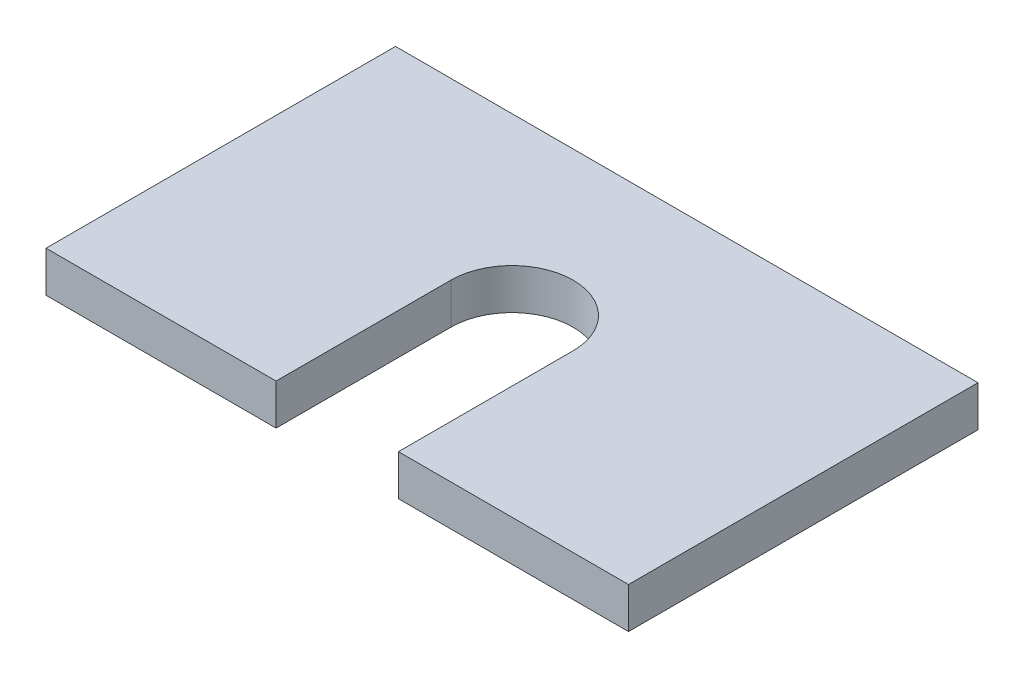
ISO-10303-21;
HEADER;
FILE_DESCRIPTION(('STEP AP214'),'2;1');
FILE_NAME('part.step','',(''),(''),'','','');
FILE_SCHEMA(('AUTOMOTIVE_DESIGN { 1 0 10303 214 1 1 1 1 }'));
ENDSEC;
DATA;
#1=APPLICATION_CONTEXT('core data for automotive mechanical design processes');
#2=APPLICATION_PROTOCOL_DEFINITION('international standard','automotive_design',2000,#1);
#3=PRODUCT_CONTEXT('',#1,'mechanical');
#4=PRODUCT('Part','Part','',(#3));
#5=PRODUCT_RELATED_PRODUCT_CATEGORY('part','',(#4));
#6=PRODUCT_DEFINITION_FORMATION('','',#4);
#7=PRODUCT_DEFINITION_CONTEXT('part definition',#1,'design');
#8=PRODUCT_DEFINITION('design','',#6,#7);
#9=PRODUCT_DEFINITION_SHAPE('','',#8);
#10=(LENGTH_UNIT() NAMED_UNIT(*) SI_UNIT(.MILLI.,.METRE.));
#11=(NAMED_UNIT(*) PLANE_ANGLE_UNIT() SI_UNIT($,.RADIAN.));
#12=(NAMED_UNIT(*) SI_UNIT($,.STERADIAN.) SOLID_ANGLE_UNIT());
#13=UNCERTAINTY_MEASURE_WITH_UNIT(LENGTH_MEASURE(1.E-05),#10,'distance_accuracy_value','');
#14=(GEOMETRIC_REPRESENTATION_CONTEXT(3) GLOBAL_UNCERTAINTY_ASSIGNED_CONTEXT((#13)) GLOBAL_UNIT_ASSIGNED_CONTEXT((#10,
#11,#12)) REPRESENTATION_CONTEXT('',''));
#15=CARTESIAN_POINT('',(0.,0.,0.));
#16=DIRECTION('',(0.,0.,1.));
#17=DIRECTION('',(1.,0.,0.));
#18=AXIS2_PLACEMENT_3D('',#15,#16,#17);
#19=CARTESIAN_POINT('',(0.,8.89,0.));
#20=DIRECTION('',(0.,-1.,0.));
#21=DIRECTION('',(0.,0.,-1.));
#22=AXIS2_PLACEMENT_3D('',#19,#20,#21);
#23=CYLINDRICAL_SURFACE('',#22,13.335);
#24=CARTESIAN_POINT('',(0.,0.,0.));
#25=DIRECTION('',(0.,1.,0.));
#26=DIRECTION('',(0.,0.,1.));
#27=AXIS2_PLACEMENT_3D('',#24,#25,#26);
#28=CIRCLE('',#27,13.335);
#29=CARTESIAN_POINT('',(13.335,0.,0.));
#30=VERTEX_POINT('',#29);
#31=CARTESIAN_POINT('',(-13.335,0.,0.));
#32=VERTEX_POINT('',#31);
#33=EDGE_CURVE('E189',#30,#32,#28,.T.);
#34=ORIENTED_EDGE('',*,*,#33,.F.);
#35=DIRECTION('',(0.,-1.,0.));
#36=VECTOR('',#35,1.);
#37=CARTESIAN_POINT('',(13.335,8.89,0.));
#38=LINE('',#37,#36);
#39=CARTESIAN_POINT('',(13.335,8.89,0.));
#40=VERTEX_POINT('',#39);
#41=EDGE_CURVE('E11',#40,#30,#38,.T.);
#42=ORIENTED_EDGE('',*,*,#41,.F.);
#43=CARTESIAN_POINT('',(0.,8.89,0.));
#44=DIRECTION('',(0.,1.,0.));
#45=DIRECTION('',(0.,0.,1.));
#46=AXIS2_PLACEMENT_3D('',#43,#44,#45);
#47=CIRCLE('',#46,13.335);
#48=CARTESIAN_POINT('',(-13.335,8.89,0.));
#49=VERTEX_POINT('',#48);
#50=EDGE_CURVE('E151',#40,#49,#47,.T.);
#51=ORIENTED_EDGE('',*,*,#50,.T.);
#52=DIRECTION('',(0.,-1.,0.));
#53=VECTOR('',#52,1.);
#54=CARTESIAN_POINT('',(-13.335,8.89,0.));
#55=LINE('',#54,#53);
#56=EDGE_CURVE('E58',#49,#32,#55,.T.);
#57=ORIENTED_EDGE('',*,*,#56,.T.);
#58=EDGE_LOOP('',(#34,#42,#51,#57));
#59=FACE_BOUND('',#58,.T.);
#60=ADVANCED_FACE('F41',(#59),#23,.F.);
#61=CARTESIAN_POINT('',(13.335,8.89,0.));
#62=DIRECTION('',(1.,0.,0.));
#63=DIRECTION('',(0.,0.,-1.));
#64=AXIS2_PLACEMENT_3D('',#61,#62,#63);
#65=PLANE('',#64);
#66=DIRECTION('',(0.,0.,1.));
#67=VECTOR('',#66,1.);
#68=CARTESIAN_POINT('',(13.335,0.,0.));
#69=LINE('',#68,#67);
#70=CARTESIAN_POINT('',(13.335,0.,38.1));
#71=VERTEX_POINT('',#70);
#72=EDGE_CURVE('E186',#30,#71,#69,.T.);
#73=ORIENTED_EDGE('',*,*,#72,.T.);
#74=DIRECTION('',(0.,-1.,0.));
#75=VECTOR('',#74,1.);
#76=CARTESIAN_POINT('',(13.335,8.89,38.1));
#77=LINE('',#76,#75);
#78=CARTESIAN_POINT('',(13.335,8.89,38.1));
#79=VERTEX_POINT('',#78);
#80=EDGE_CURVE('E50',#79,#71,#77,.T.);
#81=ORIENTED_EDGE('',*,*,#80,.F.);
#82=DIRECTION('',(0.,0.,1.));
#83=VECTOR('',#82,1.);
#84=CARTESIAN_POINT('',(13.335,8.89,0.));
#85=LINE('',#84,#83);
#86=EDGE_CURVE('E145',#40,#79,#85,.T.);
#87=ORIENTED_EDGE('',*,*,#86,.F.);
#88=ORIENTED_EDGE('',*,*,#41,.T.);
#89=EDGE_LOOP('',(#73,#81,#87,#88));
#90=FACE_BOUND('',#89,.T.);
#91=ADVANCED_FACE('F187',(#90),#65,.F.);
#92=CARTESIAN_POINT('',(0.,8.89,38.1));
#93=DIRECTION('',(0.,0.,1.));
#94=DIRECTION('',(1.,0.,0.));
#95=AXIS2_PLACEMENT_3D('',#92,#93,#94);
#96=PLANE('',#95);
#97=DIRECTION('',(-1.,0.,0.));
#98=VECTOR('',#97,1.);
#99=CARTESIAN_POINT('',(0.,0.,38.1));
#100=LINE('',#99,#98);
#101=CARTESIAN_POINT('',(63.5,0.,38.1));
#102=VERTEX_POINT('',#101);
#103=EDGE_CURVE('E163',#102,#71,#100,.T.);
#104=ORIENTED_EDGE('',*,*,#103,.F.);
#105=DIRECTION('',(0.,-1.,0.));
#106=VECTOR('',#105,1.);
#107=CARTESIAN_POINT('',(63.5,8.89,38.1));
#108=LINE('',#107,#106);
#109=CARTESIAN_POINT('',(63.5,8.89,38.1));
#110=VERTEX_POINT('',#109);
#111=EDGE_CURVE('E176',#110,#102,#108,.T.);
#112=ORIENTED_EDGE('',*,*,#111,.F.);
#113=DIRECTION('',(-1.,0.,0.));
#114=VECTOR('',#113,1.);
#115=CARTESIAN_POINT('',(0.,8.89,38.1));
#116=LINE('',#115,#114);
#117=EDGE_CURVE('E137',#110,#79,#116,.T.);
#118=ORIENTED_EDGE('',*,*,#117,.T.);
#119=ORIENTED_EDGE('',*,*,#80,.T.);
#120=EDGE_LOOP('',(#104,#112,#118,#119));
#121=FACE_BOUND('',#120,.T.);
#122=ADVANCED_FACE('F181',(#121),#96,.T.);
#123=CARTESIAN_POINT('',(63.5,8.89,0.));
#124=DIRECTION('',(1.,0.,0.));
#125=DIRECTION('',(0.,0.,-1.));
#126=AXIS2_PLACEMENT_3D('',#123,#124,#125);
#127=PLANE('',#126);
#128=DIRECTION('',(0.,0.,1.));
#129=VECTOR('',#128,1.);
#130=CARTESIAN_POINT('',(63.5,0.,0.));
#131=LINE('',#130,#129);
#132=CARTESIAN_POINT('',(63.5,0.,-38.1));
#133=VERTEX_POINT('',#132);
#134=EDGE_CURVE('E194',#133,#102,#131,.T.);
#135=ORIENTED_EDGE('',*,*,#134,.F.);
#136=DIRECTION('',(0.,-1.,0.));
#137=VECTOR('',#136,1.);
#138=CARTESIAN_POINT('',(63.5,8.89,-38.1));
#139=LINE('',#138,#137);
#140=CARTESIAN_POINT('',(63.5,8.89,-38.1));
#141=VERTEX_POINT('',#140);
#142=EDGE_CURVE('E173',#141,#133,#139,.T.);
#143=ORIENTED_EDGE('',*,*,#142,.F.);
#144=DIRECTION('',(0.,0.,1.));
#145=VECTOR('',#144,1.);
#146=CARTESIAN_POINT('',(63.5,8.89,0.));
#147=LINE('',#146,#145);
#148=EDGE_CURVE('E144',#141,#110,#147,.T.);
#149=ORIENTED_EDGE('',*,*,#148,.T.);
#150=ORIENTED_EDGE('',*,*,#111,.T.);
#151=EDGE_LOOP('',(#135,#143,#149,#150));
#152=FACE_BOUND('',#151,.T.);
#153=ADVANCED_FACE('F205',(#152),#127,.T.);
#154=CARTESIAN_POINT('',(0.,8.89,-38.1));
#155=DIRECTION('',(0.,0.,1.));
#156=DIRECTION('',(1.,0.,0.));
#157=AXIS2_PLACEMENT_3D('',#154,#155,#156);
#158=PLANE('',#157);
#159=DIRECTION('',(-1.,0.,0.));
#160=VECTOR('',#159,1.);
#161=CARTESIAN_POINT('',(0.,0.,-38.1));
#162=LINE('',#161,#160);
#163=CARTESIAN_POINT('',(-63.5,0.,-38.1));
#164=VERTEX_POINT('',#163);
#165=EDGE_CURVE('E197',#133,#164,#162,.T.);
#166=ORIENTED_EDGE('',*,*,#165,.T.);
#167=DIRECTION('',(0.,-1.,0.));
#168=VECTOR('',#167,1.);
#169=CARTESIAN_POINT('',(-63.5,8.89,-38.1));
#170=LINE('',#169,#168);
#171=CARTESIAN_POINT('',(-63.5,8.89,-38.1));
#172=VERTEX_POINT('',#171);
#173=EDGE_CURVE('E131',#172,#164,#170,.T.);
#174=ORIENTED_EDGE('',*,*,#173,.F.);
#175=DIRECTION('',(-1.,0.,0.));
#176=VECTOR('',#175,1.);
#177=CARTESIAN_POINT('',(0.,8.89,-38.1));
#178=LINE('',#177,#176);
#179=EDGE_CURVE('E117',#141,#172,#178,.T.);
#180=ORIENTED_EDGE('',*,*,#179,.F.);
#181=ORIENTED_EDGE('',*,*,#142,.T.);
#182=EDGE_LOOP('',(#166,#174,#180,#181));
#183=FACE_BOUND('',#182,.T.);
#184=ADVANCED_FACE('F203',(#183),#158,.F.);
#185=CARTESIAN_POINT('',(-63.5,8.89,0.));
#186=DIRECTION('',(1.,0.,0.));
#187=DIRECTION('',(0.,0.,-1.));
#188=AXIS2_PLACEMENT_3D('',#185,#186,#187);
#189=PLANE('',#188);
#190=DIRECTION('',(0.,0.,1.));
#191=VECTOR('',#190,1.);
#192=CARTESIAN_POINT('',(-63.5,0.,0.));
#193=LINE('',#192,#191);
#194=CARTESIAN_POINT('',(-63.5,0.,38.1));
#195=VERTEX_POINT('',#194);
#196=EDGE_CURVE('E127',#164,#195,#193,.T.);
#197=ORIENTED_EDGE('',*,*,#196,.T.);
#198=DIRECTION('',(0.,-1.,0.));
#199=VECTOR('',#198,1.);
#200=CARTESIAN_POINT('',(-63.5,8.89,38.1));
#201=LINE('',#200,#199);
#202=CARTESIAN_POINT('',(-63.5,8.89,38.1));
#203=VERTEX_POINT('',#202);
#204=EDGE_CURVE('E124',#203,#195,#201,.T.);
#205=ORIENTED_EDGE('',*,*,#204,.F.);
#206=DIRECTION('',(0.,0.,1.));
#207=VECTOR('',#206,1.);
#208=CARTESIAN_POINT('',(-63.5,8.89,0.));
#209=LINE('',#208,#207);
#210=EDGE_CURVE('E108',#172,#203,#209,.T.);
#211=ORIENTED_EDGE('',*,*,#210,.F.);
#212=ORIENTED_EDGE('',*,*,#173,.T.);
#213=EDGE_LOOP('',(#197,#205,#211,#212));
#214=FACE_BOUND('',#213,.T.);
#215=ADVANCED_FACE('F125',(#214),#189,.F.);
#216=CARTESIAN_POINT('',(-13.335,0.,38.1));
#217=VERTEX_POINT('',#216);
#218=EDGE_CURVE('E158',#217,#195,#100,.T.);
#219=ORIENTED_EDGE('',*,*,#218,.F.);
#220=DIRECTION('',(0.,-1.,0.));
#221=VECTOR('',#220,1.);
#222=CARTESIAN_POINT('',(-13.335,8.89,38.1));
#223=LINE('',#222,#221);
#224=CARTESIAN_POINT('',(-13.335,8.89,38.1));
#225=VERTEX_POINT('',#224);
#226=EDGE_CURVE('E83',#225,#217,#223,.T.);
#227=ORIENTED_EDGE('',*,*,#226,.F.);
#228=EDGE_CURVE('E114',#225,#203,#116,.T.);
#229=ORIENTED_EDGE('',*,*,#228,.T.);
#230=ORIENTED_EDGE('',*,*,#204,.T.);
#231=EDGE_LOOP('',(#219,#227,#229,#230));
#232=FACE_BOUND('',#231,.T.);
#233=ADVANCED_FACE('F133',(#232),#96,.T.);
#234=CARTESIAN_POINT('',(-13.335,8.89,0.));
#235=DIRECTION('',(1.,0.,0.));
#236=DIRECTION('',(0.,0.,-1.));
#237=AXIS2_PLACEMENT_3D('',#234,#235,#236);
#238=PLANE('',#237);
#239=DIRECTION('',(0.,0.,1.));
#240=VECTOR('',#239,1.);
#241=CARTESIAN_POINT('',(-13.335,0.,0.));
#242=LINE('',#241,#240);
#243=EDGE_CURVE('E154',#32,#217,#242,.T.);
#244=ORIENTED_EDGE('',*,*,#243,.F.);
#245=ORIENTED_EDGE('',*,*,#56,.F.);
#246=DIRECTION('',(0.,0.,1.));
#247=VECTOR('',#246,1.);
#248=CARTESIAN_POINT('',(-13.335,8.89,0.));
#249=LINE('',#248,#247);
#250=EDGE_CURVE('E135',#49,#225,#249,.T.);
#251=ORIENTED_EDGE('',*,*,#250,.T.);
#252=ORIENTED_EDGE('',*,*,#226,.T.);
#253=EDGE_LOOP('',(#244,#245,#251,#252));
#254=FACE_BOUND('',#253,.T.);
#255=ADVANCED_FACE('F209',(#254),#238,.T.);
#256=CARTESIAN_POINT('',(0.,8.89,0.));
#257=DIRECTION('',(0.,1.,0.));
#258=DIRECTION('',(0.,0.,1.));
#259=AXIS2_PLACEMENT_3D('',#256,#257,#258);
#260=PLANE('',#259);
#261=ORIENTED_EDGE('',*,*,#50,.F.);
#262=ORIENTED_EDGE('',*,*,#86,.T.);
#263=ORIENTED_EDGE('',*,*,#117,.F.);
#264=ORIENTED_EDGE('',*,*,#148,.F.);
#265=ORIENTED_EDGE('',*,*,#179,.T.);
#266=ORIENTED_EDGE('',*,*,#210,.T.);
#267=ORIENTED_EDGE('',*,*,#228,.F.);
#268=ORIENTED_EDGE('',*,*,#250,.F.);
#269=EDGE_LOOP('',(#261,#262,#263,#264,#265,#266,#267,#268));
#270=FACE_BOUND('',#269,.T.);
#271=ADVANCED_FACE('F111',(#270),#260,.T.);
#272=CARTESIAN_POINT('',(0.,0.,0.));
#273=DIRECTION('',(0.,1.,0.));
#274=DIRECTION('',(0.,0.,1.));
#275=AXIS2_PLACEMENT_3D('',#272,#273,#274);
#276=PLANE('',#275);
#277=ORIENTED_EDGE('',*,*,#33,.T.);
#278=ORIENTED_EDGE('',*,*,#243,.T.);
#279=ORIENTED_EDGE('',*,*,#218,.T.);
#280=ORIENTED_EDGE('',*,*,#196,.F.);
#281=ORIENTED_EDGE('',*,*,#165,.F.);
#282=ORIENTED_EDGE('',*,*,#134,.T.);
#283=ORIENTED_EDGE('',*,*,#103,.T.);
#284=ORIENTED_EDGE('',*,*,#72,.F.);
#285=EDGE_LOOP('',(#277,#278,#279,#280,#281,#282,#283,#284));
#286=FACE_BOUND('',#285,.T.);
#287=ADVANCED_FACE('F191',(#286),#276,.F.);
#288=CLOSED_SHELL('',(#60,#91,#122,#153,#184,#215,#233,#255,#271,#287));
#289=MANIFOLD_SOLID_BREP('B2',#288);
#290=ADVANCED_BREP_SHAPE_REPRESENTATION('',(#18,#289),#14);
#291=SHAPE_DEFINITION_REPRESENTATION(#9,#290);
ENDSEC;
END-ISO-10303-21;
